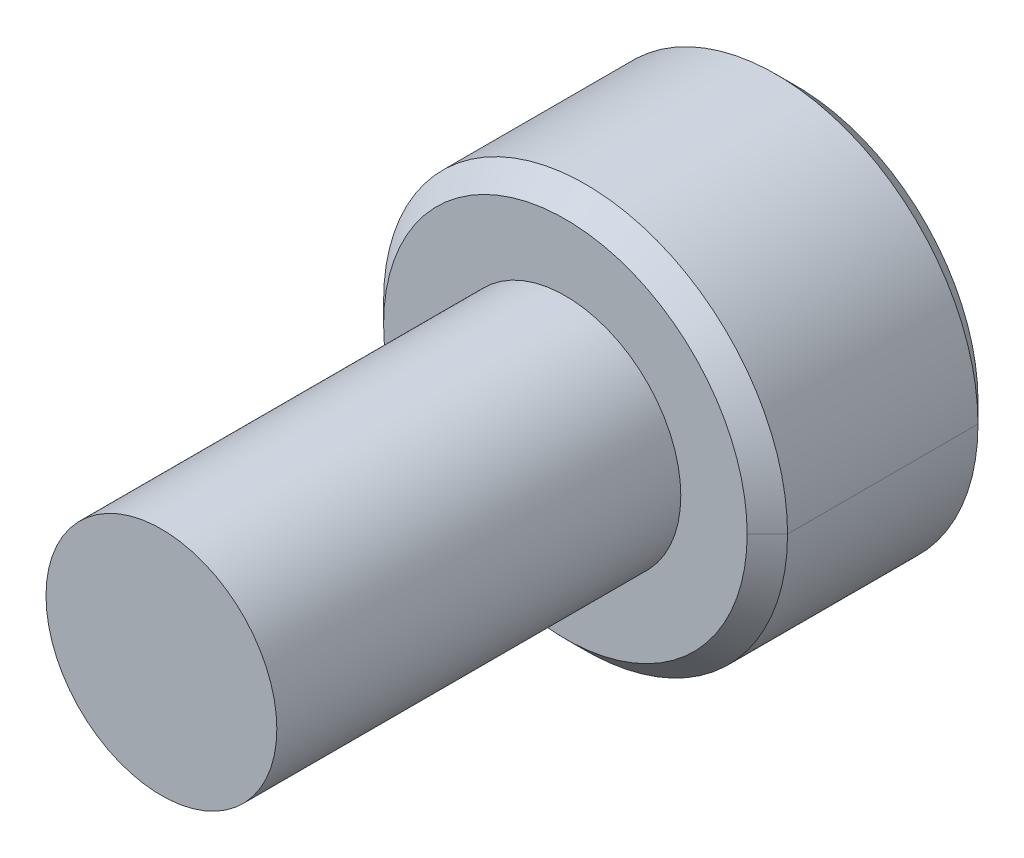
ISO-10303-21;
HEADER;
FILE_DESCRIPTION(('STEP AP214'),'2;1');
FILE_NAME('part.step','',(''),(''),'','','');
FILE_SCHEMA(('AUTOMOTIVE_DESIGN { 1 0 10303 214 1 1 1 1 }'));
ENDSEC;
DATA;
#1=APPLICATION_CONTEXT('core data for automotive mechanical design processes');
#2=APPLICATION_PROTOCOL_DEFINITION('international standard','automotive_design',2000,#1);
#3=PRODUCT_CONTEXT('',#1,'mechanical');
#4=PRODUCT('Part','Part','',(#3));
#5=PRODUCT_RELATED_PRODUCT_CATEGORY('part','',(#4));
#6=PRODUCT_DEFINITION_FORMATION('','',#4);
#7=PRODUCT_DEFINITION_CONTEXT('part definition',#1,'design');
#8=PRODUCT_DEFINITION('design','',#6,#7);
#9=PRODUCT_DEFINITION_SHAPE('','',#8);
#10=(LENGTH_UNIT() NAMED_UNIT(*) SI_UNIT(.MILLI.,.METRE.));
#11=(NAMED_UNIT(*) PLANE_ANGLE_UNIT() SI_UNIT($,.RADIAN.));
#12=(NAMED_UNIT(*) SI_UNIT($,.STERADIAN.) SOLID_ANGLE_UNIT());
#13=UNCERTAINTY_MEASURE_WITH_UNIT(LENGTH_MEASURE(1.E-05),#10,'distance_accuracy_value','');
#14=(GEOMETRIC_REPRESENTATION_CONTEXT(3) GLOBAL_UNCERTAINTY_ASSIGNED_CONTEXT((#13)) GLOBAL_UNIT_ASSIGNED_CONTEXT((#10,
#11,#12)) REPRESENTATION_CONTEXT('',''));
#15=CARTESIAN_POINT('',(0.,0.,0.));
#16=DIRECTION('',(0.,0.,1.));
#17=DIRECTION('',(1.,0.,0.));
#18=AXIS2_PLACEMENT_3D('',#15,#16,#17);
#19=CARTESIAN_POINT('',(0.,0.,-7.35));
#20=DIRECTION('',(0.,0.,-1.));
#21=DIRECTION('',(-1.,0.,0.));
#22=AXIS2_PLACEMENT_3D('',#19,#20,#21);
#23=CONICAL_SURFACE('',#22,3.5,0.785398163397448);
#24=DIRECTION('',(0.707106781186548,0.,-0.707106781186548));
#25=VECTOR('',#24,1.);
#26=CARTESIAN_POINT('',(3.5,0.,-7.35));
#27=LINE('',#26,#25);
#28=CARTESIAN_POINT('',(3.15,0.,-7.));
#29=VERTEX_POINT('',#28);
#30=CARTESIAN_POINT('',(3.5,0.,-7.35));
#31=VERTEX_POINT('',#30);
#32=EDGE_CURVE('E606',#29,#31,#27,.T.);
#33=ORIENTED_EDGE('',*,*,#32,.F.);
#34=CARTESIAN_POINT('',(0.,0.,-7.));
#35=DIRECTION('',(0.,0.,1.));
#36=DIRECTION('',(-1.,0.,0.));
#37=AXIS2_PLACEMENT_3D('',#34,#35,#36);
#38=CIRCLE('',#37,3.15);
#39=CARTESIAN_POINT('',(-3.15,0.,-7.));
#40=VERTEX_POINT('',#39);
#41=EDGE_CURVE('E590',#40,#29,#38,.T.);
#42=ORIENTED_EDGE('',*,*,#41,.F.);
#43=DIRECTION('',(-0.707106781186548,0.,-0.707106781186548));
#44=VECTOR('',#43,1.);
#45=CARTESIAN_POINT('',(-3.5,0.,-7.35));
#46=LINE('',#45,#44);
#47=CARTESIAN_POINT('',(-3.5,0.,-7.35));
#48=VERTEX_POINT('',#47);
#49=EDGE_CURVE('E381',#40,#48,#46,.T.);
#50=ORIENTED_EDGE('',*,*,#49,.T.);
#51=CARTESIAN_POINT('',(0.,0.,-7.35));
#52=DIRECTION('',(0.,0.,-1.));
#53=DIRECTION('',(-1.,0.,0.));
#54=AXIS2_PLACEMENT_3D('',#51,#52,#53);
#55=CIRCLE('',#54,3.5);
#56=EDGE_CURVE('E372',#31,#48,#55,.T.);
#57=ORIENTED_EDGE('',*,*,#56,.F.);
#58=EDGE_LOOP('',(#33,#42,#50,#57));
#59=FACE_BOUND('',#58,.T.);
#60=ADVANCED_FACE('F36',(#59),#23,.T.);
#61=CARTESIAN_POINT('',(0.,0.,-11.));
#62=DIRECTION('',(0.,0.,1.));
#63=DIRECTION('',(1.,0.,0.));
#64=AXIS2_PLACEMENT_3D('',#61,#62,#63);
#65=CONICAL_SURFACE('',#64,3.15,0.785398163397445);
#66=DIRECTION('',(-0.707106781186545,0.,0.70710678118655));
#67=VECTOR('',#66,1.);
#68=CARTESIAN_POINT('',(-3.15,0.,-11.));
#69=LINE('',#68,#67);
#70=CARTESIAN_POINT('',(-3.15,0.,-11.));
#71=VERTEX_POINT('',#70);
#72=CARTESIAN_POINT('',(-3.5,0.,-10.65));
#73=VERTEX_POINT('',#72);
#74=EDGE_CURVE('E380',#71,#73,#69,.T.);
#75=ORIENTED_EDGE('',*,*,#74,.F.);
#76=CARTESIAN_POINT('',(0.,0.,-11.));
#77=DIRECTION('',(0.,0.,-1.));
#78=DIRECTION('',(-1.,0.,0.));
#79=AXIS2_PLACEMENT_3D('',#76,#77,#78);
#80=CIRCLE('',#79,3.15);
#81=CARTESIAN_POINT('',(3.15,0.,-11.));
#82=VERTEX_POINT('',#81);
#83=EDGE_CURVE('E368',#82,#71,#80,.T.);
#84=ORIENTED_EDGE('',*,*,#83,.F.);
#85=DIRECTION('',(0.707106781186545,0.,0.70710678118655));
#86=VECTOR('',#85,1.);
#87=CARTESIAN_POINT('',(3.15,0.,-11.));
#88=LINE('',#87,#86);
#89=CARTESIAN_POINT('',(3.5,0.,-10.65));
#90=VERTEX_POINT('',#89);
#91=EDGE_CURVE('E608',#82,#90,#88,.T.);
#92=ORIENTED_EDGE('',*,*,#91,.T.);
#93=CARTESIAN_POINT('',(0.,0.,-10.65));
#94=DIRECTION('',(0.,0.,1.));
#95=DIRECTION('',(-1.,0.,0.));
#96=AXIS2_PLACEMENT_3D('',#93,#94,#95);
#97=CIRCLE('',#96,3.5);
#98=EDGE_CURVE('E595',#73,#90,#97,.T.);
#99=ORIENTED_EDGE('',*,*,#98,.F.);
#100=EDGE_LOOP('',(#75,#84,#92,#99));
#101=FACE_BOUND('',#100,.T.);
#102=ADVANCED_FACE('F405',(#101),#65,.T.);
#103=CARTESIAN_POINT('',(-1.5,0.86602540378444,-8.75));
#104=DIRECTION('',(-0.5,0.866025403784439,0.));
#105=DIRECTION('',(0.,0.,1.));
#106=AXIS2_PLACEMENT_3D('',#103,#104,#105);
#107=PLANE('',#106);
#108=DIRECTION('',(0.,0.,-1.));
#109=VECTOR('',#108,1.);
#110=CARTESIAN_POINT('',(-1.5,0.86602540378444,-8.75));
#111=LINE('',#110,#109);
#112=CARTESIAN_POINT('',(-1.5,0.86602540378444,-8.75));
#113=VERTEX_POINT('',#112);
#114=CARTESIAN_POINT('',(-1.5,0.866025403784441,-11.));
#115=VERTEX_POINT('',#114);
#116=EDGE_CURVE('E11',#113,#115,#111,.T.);
#117=ORIENTED_EDGE('',*,*,#116,.T.);
#118=CARTESIAN_POINT('',(-1.5,0.86602540378444,-11.));
#119=CARTESIAN_POINT('',(-1.09983313245014,1.09706185248512,-10.7689635512993));
#120=CARTESIAN_POINT('',(-0.752762837135629,1.29744298091268,-10.7679525849913));
#121=CARTESIAN_POINT('',(-0.403679115740525,1.49898656142986,-10.76693575386));
#122=CARTESIAN_POINT('',(0.,1.73205080756888,-11.));
#123=B_SPLINE_CURVE_WITH_KNOTS('',2,(#118,#119,#120,#121,#122),.UNSPECIFIED.,.F.,.F.,(3,2,3),
(0.,0.5,1.),.UNSPECIFIED.);
#124=CARTESIAN_POINT('',(0.,1.73205080756888,-11.));
#125=VERTEX_POINT('',#124);
#126=EDGE_CURVE('E340',#115,#125,#123,.T.);
#127=ORIENTED_EDGE('',*,*,#126,.T.);
#128=DIRECTION('',(0.,0.,-1.));
#129=VECTOR('',#128,1.);
#130=CARTESIAN_POINT('',(0.,1.73205080756888,-8.75));
#131=LINE('',#130,#129);
#132=CARTESIAN_POINT('',(0.,1.73205080756888,-8.75));
#133=VERTEX_POINT('',#132);
#134=EDGE_CURVE('E319',#133,#125,#131,.T.);
#135=ORIENTED_EDGE('',*,*,#134,.F.);
#136=DIRECTION('',(0.866025403784439,0.5,0.));
#137=VECTOR('',#136,1.);
#138=CARTESIAN_POINT('',(-1.5,0.86602540378444,-8.75));
#139=LINE('',#138,#137);
#140=EDGE_CURVE('E333',#113,#133,#139,.T.);
#141=ORIENTED_EDGE('',*,*,#140,.F.);
#142=EDGE_LOOP('',(#117,#127,#135,#141));
#143=FACE_BOUND('',#142,.T.);
#144=ADVANCED_FACE('F394',(#143),#107,.F.);
#145=CARTESIAN_POINT('',(-1.5,-0.86602540378444,-8.75));
#146=DIRECTION('',(-1.,0.,0.));
#147=DIRECTION('',(0.,0.,1.));
#148=AXIS2_PLACEMENT_3D('',#145,#146,#147);
#149=PLANE('',#148);
#150=DIRECTION('',(0.,0.,-1.));
#151=VECTOR('',#150,1.);
#152=CARTESIAN_POINT('',(-1.5,-0.86602540378444,-8.75));
#153=LINE('',#152,#151);
#154=CARTESIAN_POINT('',(-1.5,-0.86602540378444,-8.75));
#155=VERTEX_POINT('',#154);
#156=CARTESIAN_POINT('',(-1.5,-0.86602540378444,-11.));
#157=VERTEX_POINT('',#156);
#158=EDGE_CURVE('E50',#155,#157,#153,.T.);
#159=ORIENTED_EDGE('',*,*,#158,.T.);
#160=CARTESIAN_POINT('',(-1.5,-0.86602540378444,-11.));
#161=CARTESIAN_POINT('',(-1.5,-0.646658602548532,-10.890316599382));
#162=CARTESIAN_POINT('',(-1.5,-0.445863993415155,-10.8328117105534));
#163=CARTESIAN_POINT('',(-1.5,-0.219378137358729,-10.7679491924311));
#164=CARTESIAN_POINT('',(-1.5,0.,-10.7679491924311));
#165=B_SPLINE_CURVE_WITH_KNOTS('',2,(#160,#161,#162,#163,#164),.UNSPECIFIED.,.F.,.F.,(3,2,3),
(0.,0.5,1.),.UNSPECIFIED.);
#166=CARTESIAN_POINT('',(-1.5,0.,-10.7679491924311));
#167=VERTEX_POINT('',#166);
#168=EDGE_CURVE('E562',#157,#167,#165,.T.);
#169=ORIENTED_EDGE('',*,*,#168,.T.);
#170=CARTESIAN_POINT('',(-1.5,0.,-10.7679491924311));
#171=CARTESIAN_POINT('',(-1.5,0.217075978680742,-10.7679491924311));
#172=CARTESIAN_POINT('',(-1.5,0.445959967478768,-10.832839058394));
#173=CARTESIAN_POINT('',(-1.5,0.64398704588219,-10.8889808210489));
#174=CARTESIAN_POINT('',(-1.5,0.86602540378444,-11.));
#175=B_SPLINE_CURVE_WITH_KNOTS('',2,(#170,#171,#172,#173,#174),.UNSPECIFIED.,.F.,.F.,(3,2,3),
(0.,0.5,1.),.UNSPECIFIED.);
#176=EDGE_CURVE('E550',#167,#115,#175,.T.);
#177=ORIENTED_EDGE('',*,*,#176,.T.);
#178=ORIENTED_EDGE('',*,*,#116,.F.);
#179=DIRECTION('',(0.,1.,0.));
#180=VECTOR('',#179,1.);
#181=CARTESIAN_POINT('',(-1.5,-0.86602540378444,-8.75));
#182=LINE('',#181,#180);
#183=EDGE_CURVE('E360',#155,#113,#182,.T.);
#184=ORIENTED_EDGE('',*,*,#183,.F.);
#185=EDGE_LOOP('',(#159,#169,#177,#178,#184));
#186=FACE_BOUND('',#185,.T.);
#187=ADVANCED_FACE('F404',(#186),#149,.F.);
#188=CARTESIAN_POINT('',(0.,-1.73205080756887,-8.75));
#189=DIRECTION('',(-0.5,-0.866025403784439,0.));
#190=DIRECTION('',(-0.866025403784439,0.5,0.));
#191=AXIS2_PLACEMENT_3D('',#188,#189,#190);
#192=PLANE('',#191);
#193=DIRECTION('',(0.,0.,-1.));
#194=VECTOR('',#193,1.);
#195=CARTESIAN_POINT('',(0.,-1.73205080756887,-8.75));
#196=LINE('',#195,#194);
#197=CARTESIAN_POINT('',(0.,-1.73205080756887,-8.75));
#198=VERTEX_POINT('',#197);
#199=CARTESIAN_POINT('',(0.,-1.73205080756888,-11.));
#200=VERTEX_POINT('',#199);
#201=EDGE_CURVE('E439',#198,#200,#196,.T.);
#202=ORIENTED_EDGE('',*,*,#201,.T.);
#203=CARTESIAN_POINT('',(0.,-1.73205080756887,-11.));
#204=CARTESIAN_POINT('',(-0.400166867553031,-1.50101435886636,-10.7689635512975));
#205=CARTESIAN_POINT('',(-0.747237162864371,-1.30063323044064,-10.7679525849913));
#206=CARTESIAN_POINT('',(-1.09632088426269,-1.0990896499216,-10.7669357538618));
#207=CARTESIAN_POINT('',(-1.5,-0.866025403784437,-11.));
#208=B_SPLINE_CURVE_WITH_KNOTS('',2,(#203,#204,#205,#206,#207),.UNSPECIFIED.,.F.,.F.,(3,2,3),
(0.,0.5,1.),.UNSPECIFIED.);
#209=EDGE_CURVE('E553',#200,#157,#208,.T.);
#210=ORIENTED_EDGE('',*,*,#209,.T.);
#211=ORIENTED_EDGE('',*,*,#158,.F.);
#212=DIRECTION('',(-0.866025403784439,0.5,0.));
#213=VECTOR('',#212,1.);
#214=CARTESIAN_POINT('',(0.,-1.73205080756887,-8.75));
#215=LINE('',#214,#213);
#216=EDGE_CURVE('E356',#198,#155,#215,.T.);
#217=ORIENTED_EDGE('',*,*,#216,.F.);
#218=EDGE_LOOP('',(#202,#210,#211,#217));
#219=FACE_BOUND('',#218,.T.);
#220=ADVANCED_FACE('F472',(#219),#192,.F.);
#221=CARTESIAN_POINT('',(1.5,-0.866025403784439,-8.75));
#222=DIRECTION('',(0.5,-0.866025403784439,0.));
#223=DIRECTION('',(0.,0.,-1.));
#224=AXIS2_PLACEMENT_3D('',#221,#222,#223);
#225=PLANE('',#224);
#226=DIRECTION('',(0.,0.,-1.));
#227=VECTOR('',#226,1.);
#228=CARTESIAN_POINT('',(1.5,-0.866025403784439,-8.75));
#229=LINE('',#228,#227);
#230=CARTESIAN_POINT('',(1.5,-0.866025403784439,-8.75));
#231=VERTEX_POINT('',#230);
#232=CARTESIAN_POINT('',(1.5,-0.86602540378444,-11.));
#233=VERTEX_POINT('',#232);
#234=EDGE_CURVE('E318',#231,#233,#229,.T.);
#235=ORIENTED_EDGE('',*,*,#234,.T.);
#236=CARTESIAN_POINT('',(1.5,-0.866025403784439,-11.));
#237=CARTESIAN_POINT('',(1.09983313245124,-1.09706185248448,-10.7689635513));
#238=CARTESIAN_POINT('',(0.752762837135629,-1.29744298091268,-10.7679525849913));
#239=CARTESIAN_POINT('',(0.403679115741591,-1.49898656142924,-10.7669357538593));
#240=CARTESIAN_POINT('',(0.,-1.73205080756888,-11.));
#241=B_SPLINE_CURVE_WITH_KNOTS('',2,(#236,#237,#238,#239,#240),.UNSPECIFIED.,.F.,.F.,(3,2,3),
(0.,0.5,1.),.UNSPECIFIED.);
#242=EDGE_CURVE('E486',#233,#200,#241,.T.);
#243=ORIENTED_EDGE('',*,*,#242,.T.);
#244=ORIENTED_EDGE('',*,*,#201,.F.);
#245=DIRECTION('',(-0.866025403784439,-0.5,0.));
#246=VECTOR('',#245,1.);
#247=CARTESIAN_POINT('',(1.5,-0.866025403784439,-8.75));
#248=LINE('',#247,#246);
#249=EDGE_CURVE('E328',#231,#198,#248,.T.);
#250=ORIENTED_EDGE('',*,*,#249,.F.);
#251=EDGE_LOOP('',(#235,#243,#244,#250));
#252=FACE_BOUND('',#251,.T.);
#253=ADVANCED_FACE('F466',(#252),#225,.F.);
#254=CARTESIAN_POINT('',(1.5,0.86602540378444,-8.75));
#255=DIRECTION('',(1.,0.,0.));
#256=DIRECTION('',(0.,1.,0.));
#257=AXIS2_PLACEMENT_3D('',#254,#255,#256);
#258=PLANE('',#257);
#259=DIRECTION('',(0.,0.,-1.));
#260=VECTOR('',#259,1.);
#261=CARTESIAN_POINT('',(1.5,0.86602540378444,-8.75));
#262=LINE('',#261,#260);
#263=CARTESIAN_POINT('',(1.5,0.86602540378444,-8.75));
#264=VERTEX_POINT('',#263);
#265=CARTESIAN_POINT('',(1.5,0.866025403784441,-11.));
#266=VERTEX_POINT('',#265);
#267=EDGE_CURVE('E305',#264,#266,#262,.T.);
#268=ORIENTED_EDGE('',*,*,#267,.T.);
#269=CARTESIAN_POINT('',(1.5,0.866025403784441,-11.));
#270=CARTESIAN_POINT('',(1.5,0.645653699096936,-10.8898141476562));
#271=CARTESIAN_POINT('',(1.5,0.446004889101102,-10.8328518606829));
#272=CARTESIAN_POINT('',(1.5,0.218857206001409,-10.7680438034232));
#273=CARTESIAN_POINT('',(1.5,9.44212944119704E-05,-10.7679491954029));
#274=CARTESIAN_POINT('',(1.5,-0.217614156108712,-10.7678550432942));
#275=CARTESIAN_POINT('',(1.5,-0.44581918527241,-10.8327989443105));
#276=CARTESIAN_POINT('',(1.5,-0.644979895374335,-10.889477245795));
#277=CARTESIAN_POINT('',(1.5,-0.86602540378444,-11.));
#278=B_SPLINE_CURVE_WITH_KNOTS('',2,(#269,#270,#271,#272,#273,#274,#275,#276,#277),
.UNSPECIFIED.,.F.,.F.,(3,2,2,2,3),(0.,0.25,0.5,0.75,1.),.UNSPECIFIED.);
#279=EDGE_CURVE('E451',#266,#233,#278,.T.);
#280=ORIENTED_EDGE('',*,*,#279,.T.);
#281=ORIENTED_EDGE('',*,*,#234,.F.);
#282=DIRECTION('',(0.,-1.,0.));
#283=VECTOR('',#282,1.);
#284=CARTESIAN_POINT('',(1.5,0.86602540378444,-8.75));
#285=LINE('',#284,#283);
#286=EDGE_CURVE('E322',#264,#231,#285,.T.);
#287=ORIENTED_EDGE('',*,*,#286,.F.);
#288=EDGE_LOOP('',(#268,#280,#281,#287));
#289=FACE_BOUND('',#288,.T.);
#290=ADVANCED_FACE('F323',(#289),#258,.F.);
#291=CARTESIAN_POINT('',(0.,1.73205080756888,-8.75));
#292=DIRECTION('',(0.5,0.866025403784439,0.));
#293=DIRECTION('',(0.,0.,-1.));
#294=AXIS2_PLACEMENT_3D('',#291,#292,#293);
#295=PLANE('',#294);
#296=ORIENTED_EDGE('',*,*,#134,.T.);
#297=CARTESIAN_POINT('',(0.,1.73205080756888,-11.));
#298=CARTESIAN_POINT('',(0.40016686754983,1.50101435886822,-10.7689635512993));
#299=CARTESIAN_POINT('',(0.747237162864371,1.30063323044064,-10.7679525849913));
#300=CARTESIAN_POINT('',(1.09632088425948,1.09908964992346,-10.76693575386));
#301=CARTESIAN_POINT('',(1.5,0.866025403784442,-11.));
#302=B_SPLINE_CURVE_WITH_KNOTS('',2,(#297,#298,#299,#300,#301),.UNSPECIFIED.,.F.,.F.,(3,2,3),
(0.,0.5,1.),.UNSPECIFIED.);
#303=EDGE_CURVE('E311',#125,#266,#302,.T.);
#304=ORIENTED_EDGE('',*,*,#303,.T.);
#305=ORIENTED_EDGE('',*,*,#267,.F.);
#306=DIRECTION('',(0.866025403784439,-0.5,0.));
#307=VECTOR('',#306,1.);
#308=CARTESIAN_POINT('',(0.,1.73205080756888,-8.75));
#309=LINE('',#308,#307);
#310=EDGE_CURVE('E308',#133,#264,#309,.T.);
#311=ORIENTED_EDGE('',*,*,#310,.F.);
#312=EDGE_LOOP('',(#296,#304,#305,#311));
#313=FACE_BOUND('',#312,.T.);
#314=ADVANCED_FACE('F38',(#313),#295,.F.);
#315=CARTESIAN_POINT('',(1.5,2.59807621135332,-8.75));
#316=DIRECTION('',(0.,0.,-1.));
#317=DIRECTION('',(0.,-1.,0.));
#318=AXIS2_PLACEMENT_3D('',#315,#316,#317);
#319=PLANE('',#318);
#320=ORIENTED_EDGE('',*,*,#140,.T.);
#321=ORIENTED_EDGE('',*,*,#310,.T.);
#322=ORIENTED_EDGE('',*,*,#286,.T.);
#323=ORIENTED_EDGE('',*,*,#249,.T.);
#324=ORIENTED_EDGE('',*,*,#216,.T.);
#325=ORIENTED_EDGE('',*,*,#183,.T.);
#326=EDGE_LOOP('',(#320,#321,#322,#323,#324,#325));
#327=FACE_BOUND('',#326,.T.);
#328=ADVANCED_FACE('F330',(#327),#319,.T.);
#329=CARTESIAN_POINT('',(0.,0.,-11.));
#330=DIRECTION('',(0.,0.,-1.));
#331=DIRECTION('',(-1.,0.,0.));
#332=AXIS2_PLACEMENT_3D('',#329,#330,#331);
#333=CONICAL_SURFACE('',#332,1.73205080756888,0.78539816339745);
#334=CARTESIAN_POINT('',(0.,0.,-11.));
#335=DIRECTION('',(0.,0.,-1.));
#336=DIRECTION('',(-1.,0.,0.));
#337=AXIS2_PLACEMENT_3D('',#334,#335,#336);
#338=CIRCLE('',#337,1.73205080756888);
#339=EDGE_CURVE('E371',#115,#125,#338,.T.);
#340=ORIENTED_EDGE('',*,*,#339,.T.);
#341=ORIENTED_EDGE('',*,*,#126,.F.);
#342=EDGE_LOOP('',(#340,#341));
#343=FACE_BOUND('',#342,.T.);
#344=ADVANCED_FACE('F517',(#343),#333,.F.);
#345=CARTESIAN_POINT('',(0.,0.,-11.));
#346=DIRECTION('',(0.,0.,-1.));
#347=DIRECTION('',(-1.,0.,0.));
#348=AXIS2_PLACEMENT_3D('',#345,#346,#347);
#349=CONICAL_SURFACE('',#348,1.73205080756888,0.78539816339745);
#350=DIRECTION('',(-0.707106781186549,0.,-0.707106781186546));
#351=VECTOR('',#350,1.);
#352=CARTESIAN_POINT('',(-1.73205080756888,0.,-11.));
#353=LINE('',#352,#351);
#354=CARTESIAN_POINT('',(-1.73205080756888,0.,-11.));
#355=VERTEX_POINT('',#354);
#356=EDGE_CURVE('E545',#167,#355,#353,.T.);
#357=ORIENTED_EDGE('',*,*,#356,.F.);
#358=ORIENTED_EDGE('',*,*,#168,.F.);
#359=CARTESIAN_POINT('',(0.,0.,-11.));
#360=DIRECTION('',(0.,0.,-1.));
#361=DIRECTION('',(-1.,0.,0.));
#362=AXIS2_PLACEMENT_3D('',#359,#360,#361);
#363=CIRCLE('',#362,1.73205080756888);
#364=EDGE_CURVE('E538',#157,#355,#363,.T.);
#365=ORIENTED_EDGE('',*,*,#364,.T.);
#366=EDGE_LOOP('',(#357,#358,#365));
#367=FACE_BOUND('',#366,.T.);
#368=ADVANCED_FACE('F512',(#367),#349,.F.);
#369=CARTESIAN_POINT('',(0.,0.,-11.));
#370=DIRECTION('',(0.,0.,-1.));
#371=DIRECTION('',(-1.,0.,0.));
#372=AXIS2_PLACEMENT_3D('',#369,#370,#371);
#373=CONICAL_SURFACE('',#372,1.73205080756888,0.78539816339745);
#374=CARTESIAN_POINT('',(0.,0.,-11.));
#375=DIRECTION('',(0.,0.,-1.));
#376=DIRECTION('',(-1.,0.,0.));
#377=AXIS2_PLACEMENT_3D('',#374,#375,#376);
#378=CIRCLE('',#377,1.73205080756888);
#379=EDGE_CURVE('E492',#200,#157,#378,.T.);
#380=ORIENTED_EDGE('',*,*,#379,.T.);
#381=ORIENTED_EDGE('',*,*,#209,.F.);
#382=EDGE_LOOP('',(#380,#381));
#383=FACE_BOUND('',#382,.T.);
#384=ADVANCED_FACE('F420',(#383),#373,.F.);
#385=CARTESIAN_POINT('',(0.,0.,-11.));
#386=DIRECTION('',(0.,0.,-1.));
#387=DIRECTION('',(-1.,0.,0.));
#388=AXIS2_PLACEMENT_3D('',#385,#386,#387);
#389=CONICAL_SURFACE('',#388,1.73205080756888,0.78539816339745);
#390=CARTESIAN_POINT('',(0.,0.,-11.));
#391=DIRECTION('',(0.,0.,-1.));
#392=DIRECTION('',(-1.,0.,0.));
#393=AXIS2_PLACEMENT_3D('',#390,#391,#392);
#394=CIRCLE('',#393,1.73205080756888);
#395=EDGE_CURVE('E447',#233,#200,#394,.T.);
#396=ORIENTED_EDGE('',*,*,#395,.T.);
#397=ORIENTED_EDGE('',*,*,#242,.F.);
#398=EDGE_LOOP('',(#396,#397));
#399=FACE_BOUND('',#398,.T.);
#400=ADVANCED_FACE('F416',(#399),#389,.F.);
#401=CARTESIAN_POINT('',(0.,0.,-11.));
#402=DIRECTION('',(0.,0.,-1.));
#403=DIRECTION('',(-1.,0.,0.));
#404=AXIS2_PLACEMENT_3D('',#401,#402,#403);
#405=CONICAL_SURFACE('',#404,1.73205080756888,0.78539816339745);
#406=CARTESIAN_POINT('',(0.,0.,-11.));
#407=DIRECTION('',(0.,0.,-1.));
#408=DIRECTION('',(-1.,0.,0.));
#409=AXIS2_PLACEMENT_3D('',#406,#407,#408);
#410=CIRCLE('',#409,1.73205080756888);
#411=EDGE_CURVE('E442',#266,#233,#410,.T.);
#412=ORIENTED_EDGE('',*,*,#411,.T.);
#413=ORIENTED_EDGE('',*,*,#279,.F.);
#414=EDGE_LOOP('',(#412,#413));
#415=FACE_BOUND('',#414,.T.);
#416=ADVANCED_FACE('F419',(#415),#405,.F.);
#417=CARTESIAN_POINT('',(0.,0.,-11.));
#418=DIRECTION('',(0.,0.,-1.));
#419=DIRECTION('',(-1.,0.,0.));
#420=AXIS2_PLACEMENT_3D('',#417,#418,#419);
#421=CONICAL_SURFACE('',#420,1.73205080756888,0.78539816339745);
#422=CARTESIAN_POINT('',(0.,0.,-11.));
#423=DIRECTION('',(0.,0.,-1.));
#424=DIRECTION('',(-1.,0.,0.));
#425=AXIS2_PLACEMENT_3D('',#422,#423,#424);
#426=CIRCLE('',#425,1.73205080756888);
#427=EDGE_CURVE('E446',#125,#266,#426,.T.);
#428=ORIENTED_EDGE('',*,*,#427,.T.);
#429=ORIENTED_EDGE('',*,*,#303,.F.);
#430=EDGE_LOOP('',(#428,#429));
#431=FACE_BOUND('',#430,.T.);
#432=ADVANCED_FACE('F719',(#431),#421,.F.);
#433=CARTESIAN_POINT('',(0.,0.,-7.));
#434=DIRECTION('',(0.,0.,-1.));
#435=DIRECTION('',(0.,-1.,0.));
#436=AXIS2_PLACEMENT_3D('',#433,#434,#435);
#437=PLANE('',#436);
#438=CARTESIAN_POINT('',(0.,0.,-7.));
#439=DIRECTION('',(0.,0.,1.));
#440=DIRECTION('',(1.,0.,0.));
#441=AXIS2_PLACEMENT_3D('',#438,#439,#440);
#442=CIRCLE('',#441,2.);
#443=CARTESIAN_POINT('',(2.,0.,-7.));
#444=VERTEX_POINT('',#443);
#445=EDGE_CURVE('E641',#444,#444,#442,.T.);
#446=ORIENTED_EDGE('',*,*,#445,.F.);
#447=EDGE_LOOP('',(#446));
#448=FACE_BOUND('',#447,.T.);
#449=ORIENTED_EDGE('',*,*,#41,.T.);
#450=CARTESIAN_POINT('',(0.,0.,-7.));
#451=DIRECTION('',(0.,0.,1.));
#452=DIRECTION('',(-1.,0.,0.));
#453=AXIS2_PLACEMENT_3D('',#450,#451,#452);
#454=CIRCLE('',#453,3.15);
#455=EDGE_CURVE('E621',#29,#40,#454,.T.);
#456=ORIENTED_EDGE('',*,*,#455,.T.);
#457=EDGE_LOOP('',(#449,#456));
#458=FACE_BOUND('',#457,.T.);
#459=ADVANCED_FACE('F717',(#448,#458),#437,.F.);
#460=CARTESIAN_POINT('',(0.,0.,-11.));
#461=DIRECTION('',(0.,0.,-1.));
#462=DIRECTION('',(0.,-1.,0.));
#463=AXIS2_PLACEMENT_3D('',#460,#461,#462);
#464=PLANE('',#463);
#465=ORIENTED_EDGE('',*,*,#339,.F.);
#466=CARTESIAN_POINT('',(0.,0.,-11.));
#467=DIRECTION('',(0.,0.,-1.));
#468=DIRECTION('',(-1.,0.,0.));
#469=AXIS2_PLACEMENT_3D('',#466,#467,#468);
#470=CIRCLE('',#469,1.73205080756888);
#471=EDGE_CURVE('E549',#355,#115,#470,.T.);
#472=ORIENTED_EDGE('',*,*,#471,.F.);
#473=ORIENTED_EDGE('',*,*,#364,.F.);
#474=ORIENTED_EDGE('',*,*,#379,.F.);
#475=ORIENTED_EDGE('',*,*,#395,.F.);
#476=ORIENTED_EDGE('',*,*,#411,.F.);
#477=ORIENTED_EDGE('',*,*,#427,.F.);
#478=EDGE_LOOP('',(#465,#472,#473,#474,#475,#476,#477));
#479=FACE_BOUND('',#478,.T.);
#480=ORIENTED_EDGE('',*,*,#83,.T.);
#481=CARTESIAN_POINT('',(0.,0.,-11.));
#482=DIRECTION('',(0.,0.,-1.));
#483=DIRECTION('',(-1.,0.,0.));
#484=AXIS2_PLACEMENT_3D('',#481,#482,#483);
#485=CIRCLE('',#484,3.15);
#486=EDGE_CURVE('E376',#71,#82,#485,.T.);
#487=ORIENTED_EDGE('',*,*,#486,.T.);
#488=EDGE_LOOP('',(#480,#487));
#489=FACE_BOUND('',#488,.T.);
#490=ADVANCED_FACE('F569',(#479,#489),#464,.T.);
#491=CARTESIAN_POINT('',(0.,0.,-11.));
#492=DIRECTION('',(0.,0.,1.));
#493=DIRECTION('',(1.,0.,0.));
#494=AXIS2_PLACEMENT_3D('',#491,#492,#493);
#495=CYLINDRICAL_SURFACE('',#494,3.5);
#496=DIRECTION('',(0.,0.,1.));
#497=VECTOR('',#496,1.);
#498=CARTESIAN_POINT('',(-3.5,0.,-11.));
#499=LINE('',#498,#497);
#500=EDGE_CURVE('E344',#73,#48,#499,.T.);
#501=ORIENTED_EDGE('',*,*,#500,.F.);
#502=ORIENTED_EDGE('',*,*,#98,.T.);
#503=DIRECTION('',(0.,0.,1.));
#504=VECTOR('',#503,1.);
#505=CARTESIAN_POINT('',(3.5,0.,-11.));
#506=LINE('',#505,#504);
#507=EDGE_CURVE('E629',#90,#31,#506,.T.);
#508=ORIENTED_EDGE('',*,*,#507,.T.);
#509=ORIENTED_EDGE('',*,*,#56,.T.);
#510=EDGE_LOOP('',(#501,#502,#508,#509));
#511=FACE_BOUND('',#510,.T.);
#512=ADVANCED_FACE('F701',(#511),#495,.T.);
#513=CARTESIAN_POINT('',(0.,0.,-7.));
#514=DIRECTION('',(0.,0.,1.));
#515=DIRECTION('',(1.,0.,0.));
#516=AXIS2_PLACEMENT_3D('',#513,#514,#515);
#517=CYLINDRICAL_SURFACE('',#516,2.);
#518=ORIENTED_EDGE('',*,*,#445,.T.);
#519=EDGE_LOOP('',(#518));
#520=FACE_BOUND('',#519,.T.);
#521=DIRECTION('',(0.,0.,1.));
#522=VECTOR('',#521,1.);
#523=CARTESIAN_POINT('',(2.,0.,-7.));
#524=LINE('',#523,#522);
#525=CARTESIAN_POINT('',(2.,0.,-6.5625));
#526=VERTEX_POINT('',#525);
#527=CARTESIAN_POINT('',(2.,0.,-6.475));
#528=VERTEX_POINT('',#527);
#529=EDGE_CURVE('E351',#526,#528,#524,.T.);
#530=ORIENTED_EDGE('',*,*,#529,.T.);
#531=ORIENTED_EDGE('',*,*,#529,.F.);
#532=EDGE_LOOP('',(#530,#531));
#533=FACE_BOUND('',#532,.T.);
#534=DIRECTION('',(0.,0.,1.));
#535=VECTOR('',#534,1.);
#536=CARTESIAN_POINT('',(-2.,0.,-7.));
#537=LINE('',#536,#535);
#538=CARTESIAN_POINT('',(-2.,0.,-6.2125));
#539=VERTEX_POINT('',#538);
#540=CARTESIAN_POINT('',(-2.,0.,-6.125));
#541=VERTEX_POINT('',#540);
#542=EDGE_CURVE('E355',#539,#541,#537,.T.);
#543=ORIENTED_EDGE('',*,*,#542,.T.);
#544=ORIENTED_EDGE('',*,*,#542,.F.);
#545=EDGE_LOOP('',(#543,#544));
#546=FACE_BOUND('',#545,.T.);
#547=DIRECTION('',(0.,0.,1.));
#548=VECTOR('',#547,1.);
#549=CARTESIAN_POINT('',(2.,0.,-7.));
#550=LINE('',#549,#548);
#551=CARTESIAN_POINT('',(2.,0.,-5.8625));
#552=VERTEX_POINT('',#551);
#553=CARTESIAN_POINT('',(2.,0.,-5.775));
#554=VERTEX_POINT('',#553);
#555=EDGE_CURVE('E105',#552,#554,#550,.T.);
#556=ORIENTED_EDGE('',*,*,#555,.T.);
#557=ORIENTED_EDGE('',*,*,#555,.F.);
#558=EDGE_LOOP('',(#556,#557));
#559=FACE_BOUND('',#558,.T.);
#560=DIRECTION('',(0.,0.,1.));
#561=VECTOR('',#560,1.);
#562=CARTESIAN_POINT('',(-2.,0.,-7.));
#563=LINE('',#562,#561);
#564=CARTESIAN_POINT('',(-2.,0.,-5.5125));
#565=VERTEX_POINT('',#564);
#566=CARTESIAN_POINT('',(-2.,0.,-5.425));
#567=VERTEX_POINT('',#566);
#568=EDGE_CURVE('E354',#565,#567,#563,.T.);
#569=ORIENTED_EDGE('',*,*,#568,.T.);
#570=ORIENTED_EDGE('',*,*,#568,.F.);
#571=EDGE_LOOP('',(#569,#570));
#572=FACE_BOUND('',#571,.T.);
#573=DIRECTION('',(0.,0.,1.));
#574=VECTOR('',#573,1.);
#575=CARTESIAN_POINT('',(2.,0.,-7.));
#576=LINE('',#575,#574);
#577=CARTESIAN_POINT('',(2.,0.,-5.1625));
#578=VERTEX_POINT('',#577);
#579=CARTESIAN_POINT('',(2.,0.,-5.075));
#580=VERTEX_POINT('',#579);
#581=EDGE_CURVE('E373',#578,#580,#576,.T.);
#582=ORIENTED_EDGE('',*,*,#581,.T.);
#583=ORIENTED_EDGE('',*,*,#581,.F.);
#584=EDGE_LOOP('',(#582,#583));
#585=FACE_BOUND('',#584,.T.);
#586=DIRECTION('',(0.,0.,1.));
#587=VECTOR('',#586,1.);
#588=CARTESIAN_POINT('',(-2.,0.,-7.));
#589=LINE('',#588,#587);
#590=CARTESIAN_POINT('',(-2.,0.,-4.8125));
#591=VERTEX_POINT('',#590);
#592=CARTESIAN_POINT('',(-2.,0.,-4.725));
#593=VERTEX_POINT('',#592);
#594=EDGE_CURVE('E91',#591,#593,#589,.T.);
#595=ORIENTED_EDGE('',*,*,#594,.T.);
#596=ORIENTED_EDGE('',*,*,#594,.F.);
#597=EDGE_LOOP('',(#595,#596));
#598=FACE_BOUND('',#597,.T.);
#599=DIRECTION('',(0.,0.,1.));
#600=VECTOR('',#599,1.);
#601=CARTESIAN_POINT('',(2.,0.,-7.));
#602=LINE('',#601,#600);
#603=CARTESIAN_POINT('',(2.,0.,-4.4625));
#604=VERTEX_POINT('',#603);
#605=CARTESIAN_POINT('',(2.,0.,-4.375));
#606=VERTEX_POINT('',#605);
#607=EDGE_CURVE('E234',#604,#606,#602,.T.);
#608=ORIENTED_EDGE('',*,*,#607,.T.);
#609=ORIENTED_EDGE('',*,*,#607,.F.);
#610=EDGE_LOOP('',(#608,#609));
#611=FACE_BOUND('',#610,.T.);
#612=DIRECTION('',(0.,0.,1.));
#613=VECTOR('',#612,1.);
#614=CARTESIAN_POINT('',(-2.,0.,-7.));
#615=LINE('',#614,#613);
#616=CARTESIAN_POINT('',(-2.,0.,-4.1125));
#617=VERTEX_POINT('',#616);
#618=CARTESIAN_POINT('',(-2.,0.,-4.025));
#619=VERTEX_POINT('',#618);
#620=EDGE_CURVE('E240',#617,#619,#615,.T.);
#621=ORIENTED_EDGE('',*,*,#620,.T.);
#622=ORIENTED_EDGE('',*,*,#620,.F.);
#623=EDGE_LOOP('',(#621,#622));
#624=FACE_BOUND('',#623,.T.);
#625=DIRECTION('',(0.,0.,1.));
#626=VECTOR('',#625,1.);
#627=CARTESIAN_POINT('',(2.,0.,-7.));
#628=LINE('',#627,#626);
#629=CARTESIAN_POINT('',(2.,0.,-3.7625));
#630=VERTEX_POINT('',#629);
#631=CARTESIAN_POINT('',(2.,0.,-3.675));
#632=VERTEX_POINT('',#631);
#633=EDGE_CURVE('E346',#630,#632,#628,.T.);
#634=ORIENTED_EDGE('',*,*,#633,.T.);
#635=ORIENTED_EDGE('',*,*,#633,.F.);
#636=EDGE_LOOP('',(#634,#635));
#637=FACE_BOUND('',#636,.T.);
#638=DIRECTION('',(0.,0.,1.));
#639=VECTOR('',#638,1.);
#640=CARTESIAN_POINT('',(-2.,0.,-7.));
#641=LINE('',#640,#639);
#642=CARTESIAN_POINT('',(-2.,0.,-3.4125));
#643=VERTEX_POINT('',#642);
#644=CARTESIAN_POINT('',(-2.,0.,-3.325));
#645=VERTEX_POINT('',#644);
#646=EDGE_CURVE('E348',#643,#645,#641,.T.);
#647=ORIENTED_EDGE('',*,*,#646,.T.);
#648=ORIENTED_EDGE('',*,*,#646,.F.);
#649=EDGE_LOOP('',(#647,#648));
#650=FACE_BOUND('',#649,.T.);
#651=DIRECTION('',(0.,0.,1.));
#652=VECTOR('',#651,1.);
#653=CARTESIAN_POINT('',(2.,0.,-7.));
#654=LINE('',#653,#652);
#655=CARTESIAN_POINT('',(2.,0.,-3.0625));
#656=VERTEX_POINT('',#655);
#657=CARTESIAN_POINT('',(2.,0.,-2.975));
#658=VERTEX_POINT('',#657);
#659=EDGE_CURVE('E193',#656,#658,#654,.T.);
#660=ORIENTED_EDGE('',*,*,#659,.T.);
#661=ORIENTED_EDGE('',*,*,#659,.F.);
#662=EDGE_LOOP('',(#660,#661));
#663=FACE_BOUND('',#662,.T.);
#664=DIRECTION('',(0.,0.,1.));
#665=VECTOR('',#664,1.);
#666=CARTESIAN_POINT('',(-2.,0.,-7.));
#667=LINE('',#666,#665);
#668=CARTESIAN_POINT('',(-2.,0.,-2.7125));
#669=VERTEX_POINT('',#668);
#670=CARTESIAN_POINT('',(-2.,0.,-2.625));
#671=VERTEX_POINT('',#670);
#672=EDGE_CURVE('E198',#669,#671,#667,.T.);
#673=ORIENTED_EDGE('',*,*,#672,.T.);
#674=ORIENTED_EDGE('',*,*,#672,.F.);
#675=EDGE_LOOP('',(#673,#674));
#676=FACE_BOUND('',#675,.T.);
#677=DIRECTION('',(0.,0.,1.));
#678=VECTOR('',#677,1.);
#679=CARTESIAN_POINT('',(2.,0.,-7.));
#680=LINE('',#679,#678);
#681=CARTESIAN_POINT('',(2.,0.,-2.3625));
#682=VERTEX_POINT('',#681);
#683=CARTESIAN_POINT('',(2.,0.,-2.275));
#684=VERTEX_POINT('',#683);
#685=EDGE_CURVE('E365',#682,#684,#680,.T.);
#686=ORIENTED_EDGE('',*,*,#685,.T.);
#687=ORIENTED_EDGE('',*,*,#685,.F.);
#688=EDGE_LOOP('',(#686,#687));
#689=FACE_BOUND('',#688,.T.);
#690=DIRECTION('',(0.,0.,1.));
#691=VECTOR('',#690,1.);
#692=CARTESIAN_POINT('',(-2.,0.,-7.));
#693=LINE('',#692,#691);
#694=CARTESIAN_POINT('',(-2.,0.,-2.0125));
#695=VERTEX_POINT('',#694);
#696=CARTESIAN_POINT('',(-2.,0.,-1.925));
#697=VERTEX_POINT('',#696);
#698=EDGE_CURVE('E384',#695,#697,#693,.T.);
#699=ORIENTED_EDGE('',*,*,#698,.T.);
#700=ORIENTED_EDGE('',*,*,#698,.F.);
#701=EDGE_LOOP('',(#699,#700));
#702=FACE_BOUND('',#701,.T.);
#703=DIRECTION('',(0.,0.,1.));
#704=VECTOR('',#703,1.);
#705=CARTESIAN_POINT('',(2.,0.,-7.));
#706=LINE('',#705,#704);
#707=CARTESIAN_POINT('',(2.,0.,-1.6625));
#708=VERTEX_POINT('',#707);
#709=CARTESIAN_POINT('',(2.,0.,-1.575));
#710=VERTEX_POINT('',#709);
#711=EDGE_CURVE('E364',#708,#710,#706,.T.);
#712=ORIENTED_EDGE('',*,*,#711,.T.);
#713=ORIENTED_EDGE('',*,*,#711,.F.);
#714=EDGE_LOOP('',(#712,#713));
#715=FACE_BOUND('',#714,.T.);
#716=DIRECTION('',(0.,0.,1.));
#717=VECTOR('',#716,1.);
#718=CARTESIAN_POINT('',(-2.,0.,-7.));
#719=LINE('',#718,#717);
#720=CARTESIAN_POINT('',(-2.,0.,-1.3125));
#721=VERTEX_POINT('',#720);
#722=CARTESIAN_POINT('',(-2.,0.,-1.225));
#723=VERTEX_POINT('',#722);
#724=EDGE_CURVE('E361',#721,#723,#719,.T.);
#725=ORIENTED_EDGE('',*,*,#724,.T.);
#726=ORIENTED_EDGE('',*,*,#724,.F.);
#727=EDGE_LOOP('',(#725,#726));
#728=FACE_BOUND('',#727,.T.);
#729=DIRECTION('',(0.,0.,1.));
#730=VECTOR('',#729,1.);
#731=CARTESIAN_POINT('',(2.,0.,-7.));
#732=LINE('',#731,#730);
#733=CARTESIAN_POINT('',(2.,0.,-0.9625));
#734=VERTEX_POINT('',#733);
#735=CARTESIAN_POINT('',(2.,0.,-0.875));
#736=VERTEX_POINT('',#735);
#737=EDGE_CURVE('E636',#734,#736,#732,.T.);
#738=ORIENTED_EDGE('',*,*,#737,.T.);
#739=ORIENTED_EDGE('',*,*,#737,.F.);
#740=EDGE_LOOP('',(#738,#739));
#741=FACE_BOUND('',#740,.T.);
#742=DIRECTION('',(0.,0.,1.));
#743=VECTOR('',#742,1.);
#744=CARTESIAN_POINT('',(-2.,0.,-7.));
#745=LINE('',#744,#743);
#746=CARTESIAN_POINT('',(-2.,0.,-0.6125));
#747=VERTEX_POINT('',#746);
#748=CARTESIAN_POINT('',(-2.,0.,-0.525));
#749=VERTEX_POINT('',#748);
#750=EDGE_CURVE('E633',#747,#749,#745,.T.);
#751=ORIENTED_EDGE('',*,*,#750,.T.);
#752=ORIENTED_EDGE('',*,*,#750,.F.);
#753=EDGE_LOOP('',(#751,#752));
#754=FACE_BOUND('',#753,.T.);
#755=CARTESIAN_POINT('',(0.,0.,0.));
#756=DIRECTION('',(0.,0.,1.));
#757=DIRECTION('',(1.,0.,0.));
#758=AXIS2_PLACEMENT_3D('',#755,#756,#757);
#759=CIRCLE('',#758,2.);
#760=CARTESIAN_POINT('',(2.,0.,0.));
#761=VERTEX_POINT('',#760);
#762=EDGE_CURVE('E652',#761,#761,#759,.T.);
#763=ORIENTED_EDGE('',*,*,#762,.F.);
#764=EDGE_LOOP('',(#763));
#765=FACE_BOUND('',#764,.T.);
#766=ADVANCED_FACE('F697',(#520,#533,#546,#559,#572,#585,#598,#611,#624,#637,#650,#663,#676,
#689,#702,#715,#728,#741,#754,#765),#517,.T.);
#767=CARTESIAN_POINT('',(0.,0.,-11.));
#768=DIRECTION('',(0.,0.,1.));
#769=DIRECTION('',(1.,0.,0.));
#770=AXIS2_PLACEMENT_3D('',#767,#768,#769);
#771=CYLINDRICAL_SURFACE('',#770,3.5);
#772=CARTESIAN_POINT('',(0.,0.,-10.65));
#773=DIRECTION('',(0.,0.,1.));
#774=DIRECTION('',(-1.,0.,0.));
#775=AXIS2_PLACEMENT_3D('',#772,#773,#774);
#776=CIRCLE('',#775,3.5);
#777=EDGE_CURVE('E611',#90,#73,#776,.T.);
#778=ORIENTED_EDGE('',*,*,#777,.T.);
#779=ORIENTED_EDGE('',*,*,#500,.T.);
#780=CARTESIAN_POINT('',(0.,0.,-7.35));
#781=DIRECTION('',(0.,0.,-1.));
#782=DIRECTION('',(-1.,0.,0.));
#783=AXIS2_PLACEMENT_3D('',#780,#781,#782);
#784=CIRCLE('',#783,3.5);
#785=EDGE_CURVE('E602',#48,#31,#784,.T.);
#786=ORIENTED_EDGE('',*,*,#785,.T.);
#787=ORIENTED_EDGE('',*,*,#507,.F.);
#788=EDGE_LOOP('',(#778,#779,#786,#787));
#789=FACE_BOUND('',#788,.T.);
#790=ADVANCED_FACE('F700',(#789),#771,.T.);
#791=CARTESIAN_POINT('',(0.,0.,-11.));
#792=DIRECTION('',(0.,0.,-1.));
#793=DIRECTION('',(-1.,0.,0.));
#794=AXIS2_PLACEMENT_3D('',#791,#792,#793);
#795=CONICAL_SURFACE('',#794,1.73205080756888,0.78539816339745);
#796=ORIENTED_EDGE('',*,*,#176,.F.);
#797=ORIENTED_EDGE('',*,*,#356,.T.);
#798=ORIENTED_EDGE('',*,*,#471,.T.);
#799=EDGE_LOOP('',(#796,#797,#798));
#800=FACE_BOUND('',#799,.T.);
#801=ADVANCED_FACE('F422',(#800),#795,.F.);
#802=CARTESIAN_POINT('',(0.,0.,-11.));
#803=DIRECTION('',(0.,0.,1.));
#804=DIRECTION('',(1.,0.,0.));
#805=AXIS2_PLACEMENT_3D('',#802,#803,#804);
#806=CONICAL_SURFACE('',#805,3.15,0.785398163397445);
#807=ORIENTED_EDGE('',*,*,#486,.F.);
#808=ORIENTED_EDGE('',*,*,#74,.T.);
#809=ORIENTED_EDGE('',*,*,#777,.F.);
#810=ORIENTED_EDGE('',*,*,#91,.F.);
#811=EDGE_LOOP('',(#807,#808,#809,#810));
#812=FACE_BOUND('',#811,.T.);
#813=ADVANCED_FACE('F414',(#812),#806,.T.);
#814=CARTESIAN_POINT('',(0.,0.,-7.35));
#815=DIRECTION('',(0.,0.,-1.));
#816=DIRECTION('',(-1.,0.,0.));
#817=AXIS2_PLACEMENT_3D('',#814,#815,#816);
#818=CONICAL_SURFACE('',#817,3.5,0.785398163397448);
#819=ORIENTED_EDGE('',*,*,#455,.F.);
#820=ORIENTED_EDGE('',*,*,#32,.T.);
#821=ORIENTED_EDGE('',*,*,#785,.F.);
#822=ORIENTED_EDGE('',*,*,#49,.F.);
#823=EDGE_LOOP('',(#819,#820,#821,#822));
#824=FACE_BOUND('',#823,.T.);
#825=ADVANCED_FACE('F410',(#824),#818,.T.);
#826=CARTESIAN_POINT('',(0.,0.,0.));
#827=DIRECTION('',(0.,0.,1.));
#828=DIRECTION('',(1.,0.,0.));
#829=AXIS2_PLACEMENT_3D('',#826,#827,#828);
#830=PLANE('',#829);
#831=ORIENTED_EDGE('',*,*,#762,.T.);
#832=EDGE_LOOP('',(#831));
#833=FACE_BOUND('',#832,.T.);
#834=ADVANCED_FACE('F413',(#833),#830,.T.);
#835=CLOSED_SHELL('',(#60,#102,#144,#187,#220,#253,#290,#314,#328,#344,#368,#384,#400,#416,#432,
#459,#490,#512,#766,#790,#801,#813,#825,#834));
#836=MANIFOLD_SOLID_BREP('B2',#835);
#837=ADVANCED_BREP_SHAPE_REPRESENTATION('',(#18,#836),#14);
#838=SHAPE_DEFINITION_REPRESENTATION(#9,#837);
ENDSEC;
END-ISO-10303-21;
